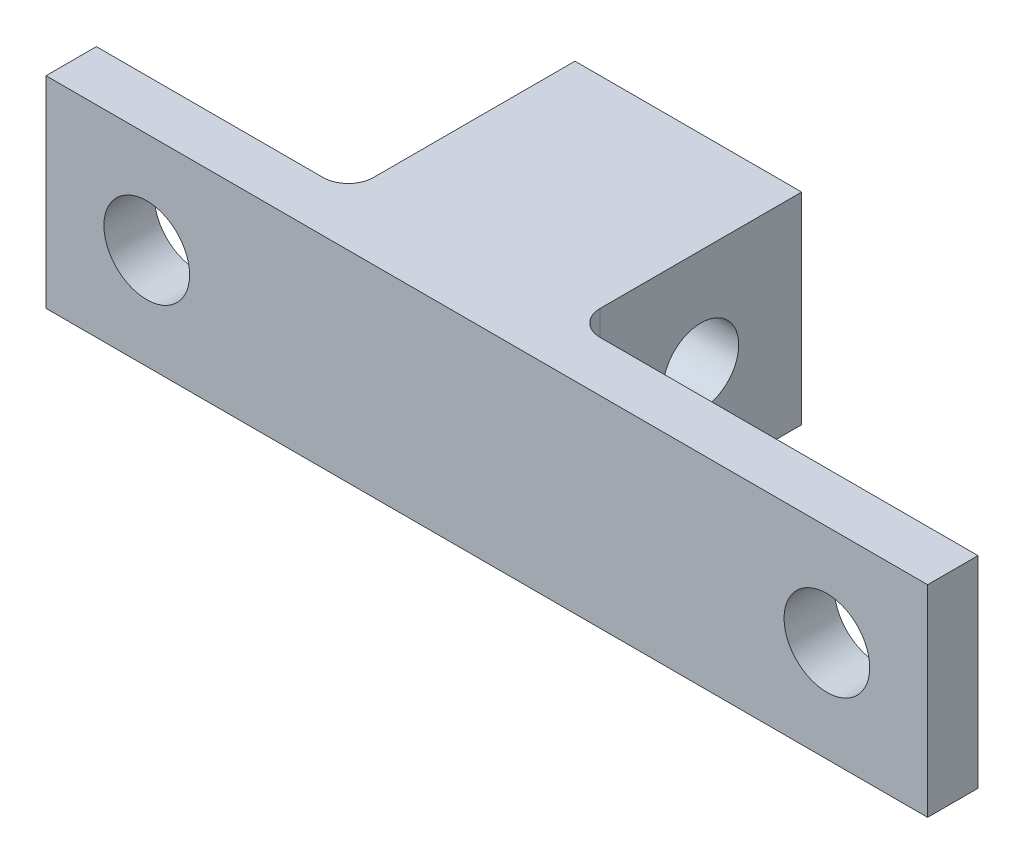
ISO-10303-21;
HEADER;
FILE_DESCRIPTION(('STEP AP214'),'2;1');
FILE_NAME('part.step','',(''),(''),'','','');
FILE_SCHEMA(('AUTOMOTIVE_DESIGN { 1 0 10303 214 1 1 1 1 }'));
ENDSEC;
DATA;
#1=APPLICATION_CONTEXT('core data for automotive mechanical design processes');
#2=APPLICATION_PROTOCOL_DEFINITION('international standard','automotive_design',2000,#1);
#3=PRODUCT_CONTEXT('',#1,'mechanical');
#4=PRODUCT('Part','Part','',(#3));
#5=PRODUCT_RELATED_PRODUCT_CATEGORY('part','',(#4));
#6=PRODUCT_DEFINITION_FORMATION('','',#4);
#7=PRODUCT_DEFINITION_CONTEXT('part definition',#1,'design');
#8=PRODUCT_DEFINITION('design','',#6,#7);
#9=PRODUCT_DEFINITION_SHAPE('','',#8);
#10=(LENGTH_UNIT() NAMED_UNIT(*) SI_UNIT(.MILLI.,.METRE.));
#11=(NAMED_UNIT(*) PLANE_ANGLE_UNIT() SI_UNIT($,.RADIAN.));
#12=(NAMED_UNIT(*) SI_UNIT($,.STERADIAN.) SOLID_ANGLE_UNIT());
#13=UNCERTAINTY_MEASURE_WITH_UNIT(LENGTH_MEASURE(1.E-05),#10,'distance_accuracy_value','');
#14=(GEOMETRIC_REPRESENTATION_CONTEXT(3) GLOBAL_UNCERTAINTY_ASSIGNED_CONTEXT((#13)) GLOBAL_UNIT_ASSIGNED_CONTEXT((#10,
#11,#12)) REPRESENTATION_CONTEXT('',''));
#15=CARTESIAN_POINT('',(0.,0.,0.));
#16=DIRECTION('',(0.,0.,1.));
#17=DIRECTION('',(1.,0.,0.));
#18=AXIS2_PLACEMENT_3D('',#15,#16,#17);
#19=CARTESIAN_POINT('',(0.,8.,0.));
#20=DIRECTION('',(0.,0.,-1.));
#21=DIRECTION('',(-1.,0.,0.));
#22=AXIS2_PLACEMENT_3D('',#19,#20,#21);
#23=PLANE('',#22);
#24=CARTESIAN_POINT('',(4.,4.,0.));
#25=DIRECTION('',(0.,0.,-1.));
#26=DIRECTION('',(-1.,0.,0.));
#27=AXIS2_PLACEMENT_3D('',#24,#25,#26);
#28=CIRCLE('',#27,1.7);
#29=CARTESIAN_POINT('',(2.3,4.,0.));
#30=VERTEX_POINT('',#29);
#31=EDGE_CURVE('E210',#30,#30,#28,.T.);
#32=ORIENTED_EDGE('',*,*,#31,.F.);
#33=EDGE_LOOP('',(#32));
#34=FACE_BOUND('',#33,.T.);
#35=DIRECTION('',(1.,0.,0.));
#36=VECTOR('',#35,1.);
#37=CARTESIAN_POINT('',(0.,8.,0.));
#38=LINE('',#37,#36);
#39=CARTESIAN_POINT('',(0.,8.,0.));
#40=VERTEX_POINT('',#39);
#41=CARTESIAN_POINT('',(9.,8.,0.));
#42=VERTEX_POINT('',#41);
#43=EDGE_CURVE('E124',#40,#42,#38,.T.);
#44=ORIENTED_EDGE('',*,*,#43,.T.);
#45=DIRECTION('',(0.,-1.,0.));
#46=VECTOR('',#45,1.);
#47=CARTESIAN_POINT('',(9.,0.,0.));
#48=LINE('',#47,#46);
#49=CARTESIAN_POINT('',(9.,0.,0.));
#50=VERTEX_POINT('',#49);
#51=EDGE_CURVE('E197',#42,#50,#48,.T.);
#52=ORIENTED_EDGE('',*,*,#51,.T.);
#53=DIRECTION('',(1.,0.,0.));
#54=VECTOR('',#53,1.);
#55=CARTESIAN_POINT('',(0.,0.,0.));
#56=LINE('',#55,#54);
#57=CARTESIAN_POINT('',(0.,0.,0.));
#58=VERTEX_POINT('',#57);
#59=EDGE_CURVE('E153',#58,#50,#56,.T.);
#60=ORIENTED_EDGE('',*,*,#59,.F.);
#61=DIRECTION('',(0.,-1.,0.));
#62=VECTOR('',#61,1.);
#63=CARTESIAN_POINT('',(0.,8.,0.));
#64=LINE('',#63,#62);
#65=EDGE_CURVE('E195',#40,#58,#64,.T.);
#66=ORIENTED_EDGE('',*,*,#65,.F.);
#67=EDGE_LOOP('',(#44,#52,#60,#66));
#68=FACE_BOUND('',#67,.T.);
#69=ADVANCED_FACE('F37',(#34,#68),#23,.T.);
#70=CARTESIAN_POINT('',(0.,8.,2.));
#71=DIRECTION('',(-1.,0.,0.));
#72=DIRECTION('',(0.,0.,1.));
#73=AXIS2_PLACEMENT_3D('',#70,#71,#72);
#74=PLANE('',#73);
#75=DIRECTION('',(0.,0.,-1.));
#76=VECTOR('',#75,1.);
#77=CARTESIAN_POINT('',(0.,0.,2.));
#78=LINE('',#77,#76);
#79=CARTESIAN_POINT('',(0.,0.,2.));
#80=VERTEX_POINT('',#79);
#81=EDGE_CURVE('E191',#80,#58,#78,.T.);
#82=ORIENTED_EDGE('',*,*,#81,.F.);
#83=DIRECTION('',(0.,-1.,0.));
#84=VECTOR('',#83,1.);
#85=CARTESIAN_POINT('',(0.,8.,2.));
#86=LINE('',#85,#84);
#87=CARTESIAN_POINT('',(0.,8.,2.));
#88=VERTEX_POINT('',#87);
#89=EDGE_CURVE('E198',#88,#80,#86,.T.);
#90=ORIENTED_EDGE('',*,*,#89,.F.);
#91=DIRECTION('',(0.,0.,-1.));
#92=VECTOR('',#91,1.);
#93=CARTESIAN_POINT('',(0.,8.,2.));
#94=LINE('',#93,#92);
#95=EDGE_CURVE('E132',#88,#40,#94,.T.);
#96=ORIENTED_EDGE('',*,*,#95,.T.);
#97=ORIENTED_EDGE('',*,*,#65,.T.);
#98=EDGE_LOOP('',(#82,#90,#96,#97));
#99=FACE_BOUND('',#98,.T.);
#100=ADVANCED_FACE('F256',(#99),#74,.T.);
#101=CARTESIAN_POINT('',(35.,8.,2.));
#102=DIRECTION('',(0.,0.,1.));
#103=DIRECTION('',(1.,0.,0.));
#104=AXIS2_PLACEMENT_3D('',#101,#102,#103);
#105=PLANE('',#104);
#106=CARTESIAN_POINT('',(4.,4.,2.));
#107=DIRECTION('',(0.,0.,1.));
#108=DIRECTION('',(1.,0.,0.));
#109=AXIS2_PLACEMENT_3D('',#106,#107,#108);
#110=CIRCLE('',#109,1.7);
#111=CARTESIAN_POINT('',(5.7,4.,2.));
#112=VERTEX_POINT('',#111);
#113=EDGE_CURVE('E206',#112,#112,#110,.T.);
#114=ORIENTED_EDGE('',*,*,#113,.F.);
#115=EDGE_LOOP('',(#114));
#116=FACE_BOUND('',#115,.T.);
#117=CARTESIAN_POINT('',(31.,4.,2.));
#118=DIRECTION('',(0.,0.,1.));
#119=DIRECTION('',(1.,0.,0.));
#120=AXIS2_PLACEMENT_3D('',#117,#118,#119);
#121=CIRCLE('',#120,1.7);
#122=CARTESIAN_POINT('',(32.7,4.,2.));
#123=VERTEX_POINT('',#122);
#124=EDGE_CURVE('E158',#123,#123,#121,.T.);
#125=ORIENTED_EDGE('',*,*,#124,.F.);
#126=EDGE_LOOP('',(#125));
#127=FACE_BOUND('',#126,.T.);
#128=DIRECTION('',(-1.,0.,0.));
#129=VECTOR('',#128,1.);
#130=CARTESIAN_POINT('',(35.,0.,2.));
#131=LINE('',#130,#129);
#132=CARTESIAN_POINT('',(35.,0.,2.));
#133=VERTEX_POINT('',#132);
#134=EDGE_CURVE('E188',#133,#80,#131,.T.);
#135=ORIENTED_EDGE('',*,*,#134,.F.);
#136=DIRECTION('',(0.,-1.,0.));
#137=VECTOR('',#136,1.);
#138=CARTESIAN_POINT('',(35.,8.,2.));
#139=LINE('',#138,#137);
#140=CARTESIAN_POINT('',(35.,8.,2.));
#141=VERTEX_POINT('',#140);
#142=EDGE_CURVE('E200',#141,#133,#139,.T.);
#143=ORIENTED_EDGE('',*,*,#142,.F.);
#144=DIRECTION('',(-1.,0.,0.));
#145=VECTOR('',#144,1.);
#146=CARTESIAN_POINT('',(35.,8.,2.));
#147=LINE('',#146,#145);
#148=EDGE_CURVE('E148',#141,#88,#147,.T.);
#149=ORIENTED_EDGE('',*,*,#148,.T.);
#150=ORIENTED_EDGE('',*,*,#89,.T.);
#151=EDGE_LOOP('',(#135,#143,#149,#150));
#152=FACE_BOUND('',#151,.T.);
#153=ADVANCED_FACE('F261',(#116,#127,#152),#105,.T.);
#154=CARTESIAN_POINT('',(35.,8.,0.));
#155=DIRECTION('',(1.,0.,0.));
#156=DIRECTION('',(0.,0.,-1.));
#157=AXIS2_PLACEMENT_3D('',#154,#155,#156);
#158=PLANE('',#157);
#159=DIRECTION('',(0.,0.,1.));
#160=VECTOR('',#159,1.);
#161=CARTESIAN_POINT('',(35.,0.,0.));
#162=LINE('',#161,#160);
#163=CARTESIAN_POINT('',(35.,0.,0.));
#164=VERTEX_POINT('',#163);
#165=EDGE_CURVE('E182',#164,#133,#162,.T.);
#166=ORIENTED_EDGE('',*,*,#165,.F.);
#167=DIRECTION('',(0.,-1.,0.));
#168=VECTOR('',#167,1.);
#169=CARTESIAN_POINT('',(35.,8.,0.));
#170=LINE('',#169,#168);
#171=CARTESIAN_POINT('',(35.,8.,0.));
#172=VERTEX_POINT('',#171);
#173=EDGE_CURVE('E202',#172,#164,#170,.T.);
#174=ORIENTED_EDGE('',*,*,#173,.F.);
#175=DIRECTION('',(0.,0.,1.));
#176=VECTOR('',#175,1.);
#177=CARTESIAN_POINT('',(35.,8.,0.));
#178=LINE('',#177,#176);
#179=EDGE_CURVE('E145',#172,#141,#178,.T.);
#180=ORIENTED_EDGE('',*,*,#179,.T.);
#181=ORIENTED_EDGE('',*,*,#142,.T.);
#182=EDGE_LOOP('',(#166,#174,#180,#181));
#183=FACE_BOUND('',#182,.T.);
#184=ADVANCED_FACE('F287',(#183),#158,.T.);
#185=CARTESIAN_POINT('',(19.,8.,0.));
#186=DIRECTION('',(0.,0.,-1.));
#187=DIRECTION('',(-1.,0.,0.));
#188=AXIS2_PLACEMENT_3D('',#185,#186,#187);
#189=PLANE('',#188);
#190=CARTESIAN_POINT('',(31.,4.,0.));
#191=DIRECTION('',(0.,0.,-1.));
#192=DIRECTION('',(-1.,0.,0.));
#193=AXIS2_PLACEMENT_3D('',#190,#191,#192);
#194=CIRCLE('',#193,1.7);
#195=CARTESIAN_POINT('',(29.3,4.,0.));
#196=VERTEX_POINT('',#195);
#197=EDGE_CURVE('E209',#196,#196,#194,.T.);
#198=ORIENTED_EDGE('',*,*,#197,.F.);
#199=EDGE_LOOP('',(#198));
#200=FACE_BOUND('',#199,.T.);
#201=DIRECTION('',(1.,0.,0.));
#202=VECTOR('',#201,1.);
#203=CARTESIAN_POINT('',(19.,0.,0.));
#204=LINE('',#203,#202);
#205=CARTESIAN_POINT('',(20.,0.,0.));
#206=VERTEX_POINT('',#205);
#207=EDGE_CURVE('E180',#206,#164,#204,.T.);
#208=ORIENTED_EDGE('',*,*,#207,.F.);
#209=DIRECTION('',(0.,-1.,0.));
#210=VECTOR('',#209,1.);
#211=CARTESIAN_POINT('',(20.,8.,0.));
#212=LINE('',#211,#210);
#213=CARTESIAN_POINT('',(20.,8.,0.));
#214=VERTEX_POINT('',#213);
#215=EDGE_CURVE('E52',#206,#214,#212,.F.);
#216=ORIENTED_EDGE('',*,*,#215,.T.);
#217=DIRECTION('',(1.,0.,0.));
#218=VECTOR('',#217,1.);
#219=CARTESIAN_POINT('',(19.,8.,0.));
#220=LINE('',#219,#218);
#221=EDGE_CURVE('E140',#214,#172,#220,.T.);
#222=ORIENTED_EDGE('',*,*,#221,.T.);
#223=ORIENTED_EDGE('',*,*,#173,.T.);
#224=EDGE_LOOP('',(#208,#216,#222,#223));
#225=FACE_BOUND('',#224,.T.);
#226=ADVANCED_FACE('F291',(#200,#225),#189,.T.);
#227=CARTESIAN_POINT('',(19.,8.,-9.));
#228=DIRECTION('',(1.,0.,0.));
#229=DIRECTION('',(0.,0.,-1.));
#230=AXIS2_PLACEMENT_3D('',#227,#228,#229);
#231=PLANE('',#230);
#232=CARTESIAN_POINT('',(19.,4.,-5.));
#233=DIRECTION('',(1.,0.,0.));
#234=DIRECTION('',(0.,0.,-1.));
#235=AXIS2_PLACEMENT_3D('',#232,#233,#234);
#236=CIRCLE('',#235,1.5);
#237=CARTESIAN_POINT('',(19.,4.,-6.5));
#238=VERTEX_POINT('',#237);
#239=EDGE_CURVE('E237',#238,#238,#236,.T.);
#240=ORIENTED_EDGE('',*,*,#239,.F.);
#241=EDGE_LOOP('',(#240));
#242=FACE_BOUND('',#241,.T.);
#243=DIRECTION('',(0.,0.,1.));
#244=VECTOR('',#243,1.);
#245=CARTESIAN_POINT('',(19.,8.,-9.));
#246=LINE('',#245,#244);
#247=CARTESIAN_POINT('',(19.,8.,-9.));
#248=VERTEX_POINT('',#247);
#249=CARTESIAN_POINT('',(19.,8.,-0.999999999999999));
#250=VERTEX_POINT('',#249);
#251=EDGE_CURVE('E138',#248,#250,#246,.T.);
#252=ORIENTED_EDGE('',*,*,#251,.T.);
#253=DIRECTION('',(0.,-1.,0.));
#254=VECTOR('',#253,1.);
#255=CARTESIAN_POINT('',(19.,0.,-0.999999999999999));
#256=LINE('',#255,#254);
#257=CARTESIAN_POINT('',(19.,0.,-0.999999999999999));
#258=VERTEX_POINT('',#257);
#259=EDGE_CURVE('E213',#250,#258,#256,.T.);
#260=ORIENTED_EDGE('',*,*,#259,.T.);
#261=DIRECTION('',(0.,0.,1.));
#262=VECTOR('',#261,1.);
#263=CARTESIAN_POINT('',(19.,0.,-9.));
#264=LINE('',#263,#262);
#265=CARTESIAN_POINT('',(19.,0.,-9.));
#266=VERTEX_POINT('',#265);
#267=EDGE_CURVE('E183',#266,#258,#264,.T.);
#268=ORIENTED_EDGE('',*,*,#267,.F.);
#269=DIRECTION('',(0.,-1.,0.));
#270=VECTOR('',#269,1.);
#271=CARTESIAN_POINT('',(19.,8.,-9.));
#272=LINE('',#271,#270);
#273=EDGE_CURVE('E131',#248,#266,#272,.T.);
#274=ORIENTED_EDGE('',*,*,#273,.F.);
#275=EDGE_LOOP('',(#252,#260,#268,#274));
#276=FACE_BOUND('',#275,.T.);
#277=ADVANCED_FACE('F218',(#242,#276),#231,.T.);
#278=CARTESIAN_POINT('',(10.,8.,-9.));
#279=DIRECTION('',(0.,0.,-1.));
#280=DIRECTION('',(-1.,0.,0.));
#281=AXIS2_PLACEMENT_3D('',#278,#279,#280);
#282=PLANE('',#281);
#283=DIRECTION('',(1.,0.,0.));
#284=VECTOR('',#283,1.);
#285=CARTESIAN_POINT('',(10.,0.,-9.));
#286=LINE('',#285,#284);
#287=CARTESIAN_POINT('',(10.,0.,-9.));
#288=VERTEX_POINT('',#287);
#289=EDGE_CURVE('E130',#288,#266,#286,.T.);
#290=ORIENTED_EDGE('',*,*,#289,.F.);
#291=DIRECTION('',(0.,-1.,0.));
#292=VECTOR('',#291,1.);
#293=CARTESIAN_POINT('',(10.,8.,-9.));
#294=LINE('',#293,#292);
#295=CARTESIAN_POINT('',(10.,8.,-9.));
#296=VERTEX_POINT('',#295);
#297=EDGE_CURVE('E116',#296,#288,#294,.T.);
#298=ORIENTED_EDGE('',*,*,#297,.F.);
#299=DIRECTION('',(1.,0.,0.));
#300=VECTOR('',#299,1.);
#301=CARTESIAN_POINT('',(10.,8.,-9.));
#302=LINE('',#301,#300);
#303=EDGE_CURVE('E123',#296,#248,#302,.T.);
#304=ORIENTED_EDGE('',*,*,#303,.T.);
#305=ORIENTED_EDGE('',*,*,#273,.T.);
#306=EDGE_LOOP('',(#290,#298,#304,#305));
#307=FACE_BOUND('',#306,.T.);
#308=ADVANCED_FACE('F128',(#307),#282,.T.);
#309=CARTESIAN_POINT('',(10.,8.,0.));
#310=DIRECTION('',(-1.,0.,0.));
#311=DIRECTION('',(0.,0.,1.));
#312=AXIS2_PLACEMENT_3D('',#309,#310,#311);
#313=PLANE('',#312);
#314=CARTESIAN_POINT('',(10.,4.,-5.));
#315=DIRECTION('',(-1.,0.,0.));
#316=DIRECTION('',(0.,0.,1.));
#317=AXIS2_PLACEMENT_3D('',#314,#315,#316);
#318=CIRCLE('',#317,1.5);
#319=CARTESIAN_POINT('',(10.,4.,-3.5));
#320=VERTEX_POINT('',#319);
#321=EDGE_CURVE('E240',#320,#320,#318,.T.);
#322=ORIENTED_EDGE('',*,*,#321,.F.);
#323=EDGE_LOOP('',(#322));
#324=FACE_BOUND('',#323,.T.);
#325=DIRECTION('',(0.,0.,-1.));
#326=VECTOR('',#325,1.);
#327=CARTESIAN_POINT('',(10.,0.,0.));
#328=LINE('',#327,#326);
#329=CARTESIAN_POINT('',(10.,0.,-1.));
#330=VERTEX_POINT('',#329);
#331=EDGE_CURVE('E157',#330,#288,#328,.T.);
#332=ORIENTED_EDGE('',*,*,#331,.F.);
#333=DIRECTION('',(0.,-1.,0.));
#334=VECTOR('',#333,1.);
#335=CARTESIAN_POINT('',(10.,8.,-1.));
#336=LINE('',#335,#334);
#337=CARTESIAN_POINT('',(10.,8.,-1.));
#338=VERTEX_POINT('',#337);
#339=EDGE_CURVE('E119',#330,#338,#336,.F.);
#340=ORIENTED_EDGE('',*,*,#339,.T.);
#341=DIRECTION('',(0.,0.,-1.));
#342=VECTOR('',#341,1.);
#343=CARTESIAN_POINT('',(10.,8.,0.));
#344=LINE('',#343,#342);
#345=EDGE_CURVE('E112',#338,#296,#344,.T.);
#346=ORIENTED_EDGE('',*,*,#345,.T.);
#347=ORIENTED_EDGE('',*,*,#297,.T.);
#348=EDGE_LOOP('',(#332,#340,#346,#347));
#349=FACE_BOUND('',#348,.T.);
#350=ADVANCED_FACE('F115',(#324,#349),#313,.T.);
#351=CARTESIAN_POINT('',(0.,8.,0.));
#352=DIRECTION('',(0.,1.,0.));
#353=DIRECTION('',(0.,0.,1.));
#354=AXIS2_PLACEMENT_3D('',#351,#352,#353);
#355=PLANE('',#354);
#356=ORIENTED_EDGE('',*,*,#43,.F.);
#357=ORIENTED_EDGE('',*,*,#95,.F.);
#358=ORIENTED_EDGE('',*,*,#148,.F.);
#359=ORIENTED_EDGE('',*,*,#179,.F.);
#360=ORIENTED_EDGE('',*,*,#221,.F.);
#361=CARTESIAN_POINT('',(20.,8.,-0.999999999999999));
#362=DIRECTION('',(0.,1.,0.));
#363=DIRECTION('',(0.,0.,1.));
#364=AXIS2_PLACEMENT_3D('',#361,#362,#363);
#365=CIRCLE('',#364,1.);
#366=EDGE_CURVE('E12',#214,#250,#365,.F.);
#367=ORIENTED_EDGE('',*,*,#366,.T.);
#368=ORIENTED_EDGE('',*,*,#251,.F.);
#369=ORIENTED_EDGE('',*,*,#303,.F.);
#370=ORIENTED_EDGE('',*,*,#345,.F.);
#371=CARTESIAN_POINT('',(9.,8.,-1.));
#372=DIRECTION('',(0.,1.,0.));
#373=DIRECTION('',(0.,0.,1.));
#374=AXIS2_PLACEMENT_3D('',#371,#372,#373);
#375=CIRCLE('',#374,1.);
#376=EDGE_CURVE('E170',#338,#42,#375,.F.);
#377=ORIENTED_EDGE('',*,*,#376,.T.);
#378=EDGE_LOOP('',(#356,#357,#358,#359,#360,#367,#368,#369,#370,#377));
#379=FACE_BOUND('',#378,.T.);
#380=ADVANCED_FACE('F136',(#379),#355,.T.);
#381=CARTESIAN_POINT('',(0.,0.,0.));
#382=DIRECTION('',(0.,1.,0.));
#383=DIRECTION('',(0.,0.,1.));
#384=AXIS2_PLACEMENT_3D('',#381,#382,#383);
#385=PLANE('',#384);
#386=ORIENTED_EDGE('',*,*,#59,.T.);
#387=CARTESIAN_POINT('',(9.,0.,-1.));
#388=DIRECTION('',(0.,1.,0.));
#389=DIRECTION('',(0.,0.,1.));
#390=AXIS2_PLACEMENT_3D('',#387,#388,#389);
#391=CIRCLE('',#390,1.);
#392=EDGE_CURVE('E166',#50,#330,#391,.T.);
#393=ORIENTED_EDGE('',*,*,#392,.T.);
#394=ORIENTED_EDGE('',*,*,#331,.T.);
#395=ORIENTED_EDGE('',*,*,#289,.T.);
#396=ORIENTED_EDGE('',*,*,#267,.T.);
#397=CARTESIAN_POINT('',(20.,0.,-0.999999999999999));
#398=DIRECTION('',(0.,1.,0.));
#399=DIRECTION('',(0.,0.,1.));
#400=AXIS2_PLACEMENT_3D('',#397,#398,#399);
#401=CIRCLE('',#400,1.);
#402=EDGE_CURVE('E45',#258,#206,#401,.T.);
#403=ORIENTED_EDGE('',*,*,#402,.T.);
#404=ORIENTED_EDGE('',*,*,#207,.T.);
#405=ORIENTED_EDGE('',*,*,#165,.T.);
#406=ORIENTED_EDGE('',*,*,#134,.T.);
#407=ORIENTED_EDGE('',*,*,#81,.T.);
#408=EDGE_LOOP('',(#386,#393,#394,#395,#396,#403,#404,#405,#406,#407));
#409=FACE_BOUND('',#408,.T.);
#410=ADVANCED_FACE('F221',(#409),#385,.F.);
#411=CARTESIAN_POINT('',(31.,4.,0.));
#412=DIRECTION('',(0.,0.,-1.));
#413=DIRECTION('',(-1.,0.,0.));
#414=AXIS2_PLACEMENT_3D('',#411,#412,#413);
#415=CYLINDRICAL_SURFACE('',#414,1.7);
#416=ORIENTED_EDGE('',*,*,#124,.T.);
#417=EDGE_LOOP('',(#416));
#418=FACE_BOUND('',#417,.T.);
#419=ORIENTED_EDGE('',*,*,#197,.T.);
#420=EDGE_LOOP('',(#419));
#421=FACE_BOUND('',#420,.T.);
#422=ADVANCED_FACE('F276',(#418,#421),#415,.F.);
#423=CARTESIAN_POINT('',(4.,4.,0.));
#424=DIRECTION('',(0.,0.,-1.));
#425=DIRECTION('',(-1.,0.,0.));
#426=AXIS2_PLACEMENT_3D('',#423,#424,#425);
#427=CYLINDRICAL_SURFACE('',#426,1.7);
#428=ORIENTED_EDGE('',*,*,#113,.T.);
#429=EDGE_LOOP('',(#428));
#430=FACE_BOUND('',#429,.T.);
#431=ORIENTED_EDGE('',*,*,#31,.T.);
#432=EDGE_LOOP('',(#431));
#433=FACE_BOUND('',#432,.T.);
#434=ADVANCED_FACE('F270',(#430,#433),#427,.F.);
#435=CARTESIAN_POINT('',(35.,4.,-5.));
#436=DIRECTION('',(-1.,0.,0.));
#437=DIRECTION('',(0.,0.,1.));
#438=AXIS2_PLACEMENT_3D('',#435,#436,#437);
#439=CYLINDRICAL_SURFACE('',#438,1.5);
#440=ORIENTED_EDGE('',*,*,#239,.T.);
#441=EDGE_LOOP('',(#440));
#442=FACE_BOUND('',#441,.T.);
#443=ORIENTED_EDGE('',*,*,#321,.T.);
#444=EDGE_LOOP('',(#443));
#445=FACE_BOUND('',#444,.T.);
#446=ADVANCED_FACE('F244',(#442,#445),#439,.F.);
#447=CARTESIAN_POINT('',(9.,8.,-1.));
#448=DIRECTION('',(0.,1.,0.));
#449=DIRECTION('',(0.,0.,1.));
#450=AXIS2_PLACEMENT_3D('',#447,#448,#449);
#451=CYLINDRICAL_SURFACE('',#450,1.);
#452=ORIENTED_EDGE('',*,*,#376,.F.);
#453=ORIENTED_EDGE('',*,*,#339,.F.);
#454=ORIENTED_EDGE('',*,*,#392,.F.);
#455=ORIENTED_EDGE('',*,*,#51,.F.);
#456=EDGE_LOOP('',(#452,#453,#454,#455));
#457=FACE_BOUND('',#456,.T.);
#458=ADVANCED_FACE('F224',(#457),#451,.F.);
#459=CARTESIAN_POINT('',(20.,8.,-0.999999999999999));
#460=DIRECTION('',(0.,1.,0.));
#461=DIRECTION('',(0.,0.,1.));
#462=AXIS2_PLACEMENT_3D('',#459,#460,#461);
#463=CYLINDRICAL_SURFACE('',#462,1.);
#464=ORIENTED_EDGE('',*,*,#366,.F.);
#465=ORIENTED_EDGE('',*,*,#215,.F.);
#466=ORIENTED_EDGE('',*,*,#402,.F.);
#467=ORIENTED_EDGE('',*,*,#259,.F.);
#468=EDGE_LOOP('',(#464,#465,#466,#467));
#469=FACE_BOUND('',#468,.T.);
#470=ADVANCED_FACE('F39',(#469),#463,.F.);
#471=CLOSED_SHELL('',(#69,#100,#153,#184,#226,#277,#308,#350,#380,#410,#422,#434,#446,#458,#470));
#472=MANIFOLD_SOLID_BREP('B2',#471);
#473=ADVANCED_BREP_SHAPE_REPRESENTATION('',(#18,#472),#14);
#474=SHAPE_DEFINITION_REPRESENTATION(#9,#473);
ENDSEC;
END-ISO-10303-21;
